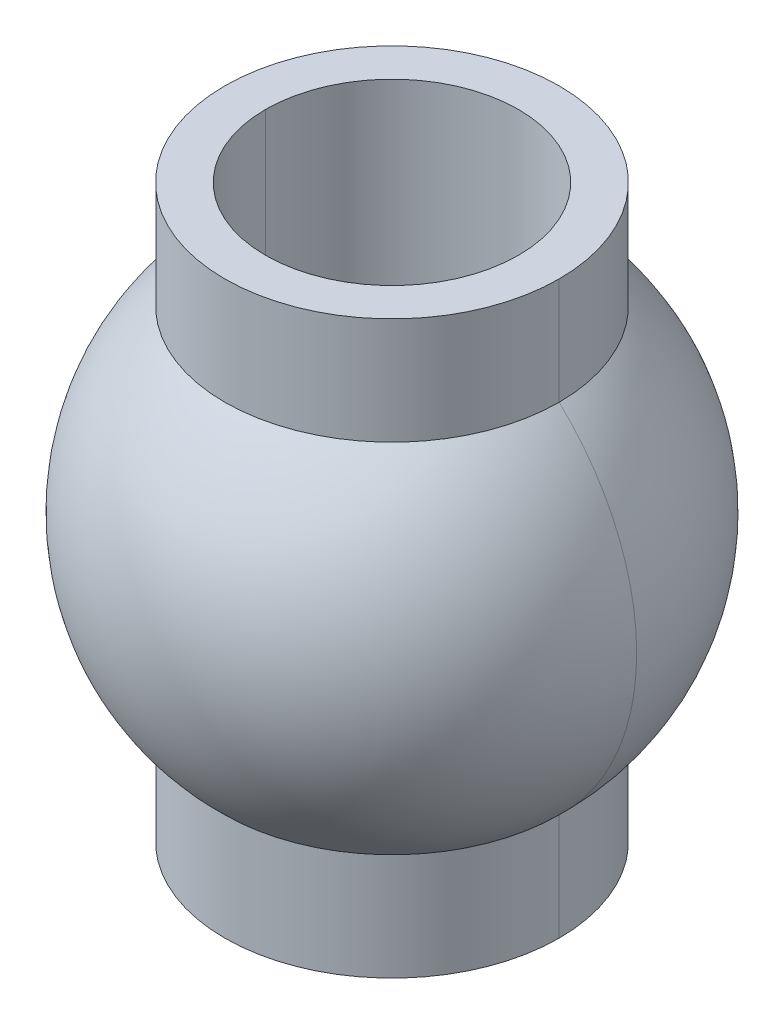
ISO-10303-21;
HEADER;
FILE_DESCRIPTION(('STEP AP214'),'2;1');
FILE_NAME('part.step','',(''),(''),'','','');
FILE_SCHEMA(('AUTOMOTIVE_DESIGN { 1 0 10303 214 1 1 1 1 }'));
ENDSEC;
DATA;
#1=APPLICATION_CONTEXT('core data for automotive mechanical design processes');
#2=APPLICATION_PROTOCOL_DEFINITION('international standard','automotive_design',2000,#1);
#3=PRODUCT_CONTEXT('',#1,'mechanical');
#4=PRODUCT('Part','Part','',(#3));
#5=PRODUCT_RELATED_PRODUCT_CATEGORY('part','',(#4));
#6=PRODUCT_DEFINITION_FORMATION('','',#4);
#7=PRODUCT_DEFINITION_CONTEXT('part definition',#1,'design');
#8=PRODUCT_DEFINITION('design','',#6,#7);
#9=PRODUCT_DEFINITION_SHAPE('','',#8);
#10=(LENGTH_UNIT() NAMED_UNIT(*) SI_UNIT(.MILLI.,.METRE.));
#11=(NAMED_UNIT(*) PLANE_ANGLE_UNIT() SI_UNIT($,.RADIAN.));
#12=(NAMED_UNIT(*) SI_UNIT($,.STERADIAN.) SOLID_ANGLE_UNIT());
#13=UNCERTAINTY_MEASURE_WITH_UNIT(LENGTH_MEASURE(1.E-05),#10,'distance_accuracy_value','');
#14=(GEOMETRIC_REPRESENTATION_CONTEXT(3) GLOBAL_UNCERTAINTY_ASSIGNED_CONTEXT((#13)) GLOBAL_UNIT_ASSIGNED_CONTEXT((#10,
#11,#12)) REPRESENTATION_CONTEXT('',''));
#15=CARTESIAN_POINT('',(0.,0.,0.));
#16=DIRECTION('',(0.,0.,1.));
#17=DIRECTION('',(1.,0.,0.));
#18=AXIS2_PLACEMENT_3D('',#15,#16,#17);
#19=CARTESIAN_POINT('',(0.,0.,0.));
#20=DIRECTION('',(0.,0.,-1.));
#21=DIRECTION('',(1.,0.,0.));
#22=AXIS2_PLACEMENT_3D('',#19,#20,#21);
#23=SPHERICAL_SURFACE('',#22,3.);
#24=CARTESIAN_POINT('',(0.,-2.19031961138095,0.));
#25=DIRECTION('',(0.,1.,0.));
#26=DIRECTION('',(-1.,0.,0.));
#27=AXIS2_PLACEMENT_3D('',#24,#25,#26);
#28=CIRCLE('',#27,2.05);
#29=CARTESIAN_POINT('',(2.05,-2.19031961138095,0.));
#30=VERTEX_POINT('',#29);
#31=CARTESIAN_POINT('',(-2.05,-2.19031961138095,0.));
#32=VERTEX_POINT('',#31);
#33=EDGE_CURVE('E11',#30,#32,#28,.T.);
#34=ORIENTED_EDGE('',*,*,#33,.T.);
#35=CARTESIAN_POINT('',(0.,0.,0.));
#36=DIRECTION('',(0.,0.,-1.));
#37=DIRECTION('',(-1.,0.,0.));
#38=AXIS2_PLACEMENT_3D('',#35,#36,#37);
#39=CIRCLE('',#38,3.);
#40=CARTESIAN_POINT('',(-2.05,2.19031961138095,0.));
#41=VERTEX_POINT('',#40);
#42=EDGE_CURVE('E27',#32,#41,#39,.T.);
#43=ORIENTED_EDGE('',*,*,#42,.T.);
#44=CARTESIAN_POINT('',(0.,2.19031961138095,0.));
#45=DIRECTION('',(0.,1.,0.));
#46=DIRECTION('',(-1.,0.,0.));
#47=AXIS2_PLACEMENT_3D('',#44,#45,#46);
#48=CIRCLE('',#47,2.05);
#49=CARTESIAN_POINT('',(2.05,2.19031961138095,0.));
#50=VERTEX_POINT('',#49);
#51=EDGE_CURVE('E142',#50,#41,#48,.T.);
#52=ORIENTED_EDGE('',*,*,#51,.F.);
#53=CARTESIAN_POINT('',(0.,0.,0.));
#54=DIRECTION('',(0.,0.,1.));
#55=DIRECTION('',(1.,0.,0.));
#56=AXIS2_PLACEMENT_3D('',#53,#54,#55);
#57=CIRCLE('',#56,3.);
#58=EDGE_CURVE('E136',#30,#50,#57,.T.);
#59=ORIENTED_EDGE('',*,*,#58,.F.);
#60=EDGE_LOOP('',(#34,#43,#52,#59));
#61=FACE_BOUND('',#60,.T.);
#62=ADVANCED_FACE('F16',(#61),#23,.T.);
#63=CARTESIAN_POINT('',(0.,3.5,0.));
#64=DIRECTION('',(0.,1.,0.));
#65=DIRECTION('',(-1.,0.,0.));
#66=AXIS2_PLACEMENT_3D('',#63,#64,#65);
#67=CYLINDRICAL_SURFACE('',#66,2.05);
#68=CARTESIAN_POINT('',(0.,-3.5,0.));
#69=DIRECTION('',(0.,1.,0.));
#70=DIRECTION('',(-1.,0.,0.));
#71=AXIS2_PLACEMENT_3D('',#68,#69,#70);
#72=CIRCLE('',#71,2.05);
#73=CARTESIAN_POINT('',(-2.05,-3.5,0.));
#74=VERTEX_POINT('',#73);
#75=CARTESIAN_POINT('',(2.05,-3.5,0.));
#76=VERTEX_POINT('',#75);
#77=EDGE_CURVE('E133',#74,#76,#72,.T.);
#78=ORIENTED_EDGE('',*,*,#77,.T.);
#79=DIRECTION('',(0.,1.,0.));
#80=VECTOR('',#79,1.);
#81=CARTESIAN_POINT('',(2.05,3.5,0.));
#82=LINE('',#81,#80);
#83=EDGE_CURVE('E115',#76,#30,#82,.T.);
#84=ORIENTED_EDGE('',*,*,#83,.T.);
#85=CARTESIAN_POINT('',(0.,-2.19031961138095,0.));
#86=DIRECTION('',(0.,1.,0.));
#87=DIRECTION('',(-1.,0.,0.));
#88=AXIS2_PLACEMENT_3D('',#85,#86,#87);
#89=CIRCLE('',#88,2.05);
#90=EDGE_CURVE('E42',#32,#30,#89,.T.);
#91=ORIENTED_EDGE('',*,*,#90,.F.);
#92=DIRECTION('',(0.,1.,0.));
#93=VECTOR('',#92,1.);
#94=CARTESIAN_POINT('',(-2.05,3.5,0.));
#95=LINE('',#94,#93);
#96=EDGE_CURVE('E135',#74,#32,#95,.T.);
#97=ORIENTED_EDGE('',*,*,#96,.F.);
#98=EDGE_LOOP('',(#78,#84,#91,#97));
#99=FACE_BOUND('',#98,.T.);
#100=ADVANCED_FACE('F196',(#99),#67,.T.);
#101=CARTESIAN_POINT('',(0.,3.5,0.));
#102=DIRECTION('',(0.,1.,0.));
#103=DIRECTION('',(-1.,0.,0.));
#104=AXIS2_PLACEMENT_3D('',#101,#102,#103);
#105=CYLINDRICAL_SURFACE('',#104,1.55);
#106=CARTESIAN_POINT('',(0.,-3.5,0.));
#107=DIRECTION('',(0.,1.,0.));
#108=DIRECTION('',(-1.,0.,0.));
#109=AXIS2_PLACEMENT_3D('',#106,#107,#108);
#110=CIRCLE('',#109,1.55);
#111=CARTESIAN_POINT('',(1.55,-3.5,0.));
#112=VERTEX_POINT('',#111);
#113=CARTESIAN_POINT('',(-1.55,-3.5,0.));
#114=VERTEX_POINT('',#113);
#115=EDGE_CURVE('E97',#112,#114,#110,.T.);
#116=ORIENTED_EDGE('',*,*,#115,.F.);
#117=DIRECTION('',(0.,1.,0.));
#118=VECTOR('',#117,1.);
#119=CARTESIAN_POINT('',(1.55,3.5,0.));
#120=LINE('',#119,#118);
#121=CARTESIAN_POINT('',(1.55,3.5,0.));
#122=VERTEX_POINT('',#121);
#123=EDGE_CURVE('E101',#112,#122,#120,.T.);
#124=ORIENTED_EDGE('',*,*,#123,.T.);
#125=CARTESIAN_POINT('',(0.,3.5,0.));
#126=DIRECTION('',(0.,1.,0.));
#127=DIRECTION('',(-1.,0.,0.));
#128=AXIS2_PLACEMENT_3D('',#125,#126,#127);
#129=CIRCLE('',#128,1.55);
#130=CARTESIAN_POINT('',(-1.55,3.5,0.));
#131=VERTEX_POINT('',#130);
#132=EDGE_CURVE('E116',#122,#131,#129,.T.);
#133=ORIENTED_EDGE('',*,*,#132,.T.);
#134=DIRECTION('',(0.,1.,0.));
#135=VECTOR('',#134,1.);
#136=CARTESIAN_POINT('',(-1.55,3.5,0.));
#137=LINE('',#136,#135);
#138=EDGE_CURVE('E20',#114,#131,#137,.T.);
#139=ORIENTED_EDGE('',*,*,#138,.F.);
#140=EDGE_LOOP('',(#116,#124,#133,#139));
#141=FACE_BOUND('',#140,.T.);
#142=ADVANCED_FACE('F99',(#141),#105,.F.);
#143=CARTESIAN_POINT('',(0.,3.5,0.));
#144=DIRECTION('',(0.,1.,0.));
#145=DIRECTION('',(-1.,0.,0.));
#146=AXIS2_PLACEMENT_3D('',#143,#144,#145);
#147=CYLINDRICAL_SURFACE('',#146,2.05);
#148=CARTESIAN_POINT('',(0.,2.19031961138095,0.));
#149=DIRECTION('',(0.,1.,0.));
#150=DIRECTION('',(-1.,0.,0.));
#151=AXIS2_PLACEMENT_3D('',#148,#149,#150);
#152=CIRCLE('',#151,2.05);
#153=EDGE_CURVE('E141',#41,#50,#152,.T.);
#154=ORIENTED_EDGE('',*,*,#153,.T.);
#155=DIRECTION('',(0.,1.,0.));
#156=VECTOR('',#155,1.);
#157=CARTESIAN_POINT('',(2.05,3.5,0.));
#158=LINE('',#157,#156);
#159=CARTESIAN_POINT('',(2.05,3.5,0.));
#160=VERTEX_POINT('',#159);
#161=EDGE_CURVE('E138',#50,#160,#158,.T.);
#162=ORIENTED_EDGE('',*,*,#161,.T.);
#163=CARTESIAN_POINT('',(0.,3.5,0.));
#164=DIRECTION('',(0.,1.,0.));
#165=DIRECTION('',(-1.,0.,0.));
#166=AXIS2_PLACEMENT_3D('',#163,#164,#165);
#167=CIRCLE('',#166,2.05);
#168=CARTESIAN_POINT('',(-2.05,3.5,0.));
#169=VERTEX_POINT('',#168);
#170=EDGE_CURVE('E74',#169,#160,#167,.T.);
#171=ORIENTED_EDGE('',*,*,#170,.F.);
#172=DIRECTION('',(0.,1.,0.));
#173=VECTOR('',#172,1.);
#174=CARTESIAN_POINT('',(-2.05,3.5,0.));
#175=LINE('',#174,#173);
#176=EDGE_CURVE('E163',#41,#169,#175,.T.);
#177=ORIENTED_EDGE('',*,*,#176,.F.);
#178=EDGE_LOOP('',(#154,#162,#171,#177));
#179=FACE_BOUND('',#178,.T.);
#180=ADVANCED_FACE('F170',(#179),#147,.T.);
#181=CARTESIAN_POINT('',(0.,3.5,0.));
#182=DIRECTION('',(0.,1.,0.));
#183=DIRECTION('',(-1.,0.,0.));
#184=AXIS2_PLACEMENT_3D('',#181,#182,#183);
#185=CYLINDRICAL_SURFACE('',#184,2.05);
#186=ORIENTED_EDGE('',*,*,#161,.F.);
#187=ORIENTED_EDGE('',*,*,#51,.T.);
#188=ORIENTED_EDGE('',*,*,#176,.T.);
#189=CARTESIAN_POINT('',(0.,3.5,0.));
#190=DIRECTION('',(0.,1.,0.));
#191=DIRECTION('',(-1.,0.,0.));
#192=AXIS2_PLACEMENT_3D('',#189,#190,#191);
#193=CIRCLE('',#192,2.05);
#194=EDGE_CURVE('E129',#160,#169,#193,.T.);
#195=ORIENTED_EDGE('',*,*,#194,.F.);
#196=EDGE_LOOP('',(#186,#187,#188,#195));
#197=FACE_BOUND('',#196,.T.);
#198=ADVANCED_FACE('F18',(#197),#185,.T.);
#199=CARTESIAN_POINT('',(1.55,3.5,0.));
#200=DIRECTION('',(0.,-1.,0.));
#201=DIRECTION('',(0.,0.,-1.));
#202=AXIS2_PLACEMENT_3D('',#199,#200,#201);
#203=PLANE('',#202);
#204=ORIENTED_EDGE('',*,*,#170,.T.);
#205=ORIENTED_EDGE('',*,*,#194,.T.);
#206=EDGE_LOOP('',(#204,#205));
#207=FACE_BOUND('',#206,.T.);
#208=CARTESIAN_POINT('',(0.,3.5,0.));
#209=DIRECTION('',(0.,1.,0.));
#210=DIRECTION('',(-1.,0.,0.));
#211=AXIS2_PLACEMENT_3D('',#208,#209,#210);
#212=CIRCLE('',#211,1.55);
#213=EDGE_CURVE('E113',#131,#122,#212,.T.);
#214=ORIENTED_EDGE('',*,*,#213,.F.);
#215=ORIENTED_EDGE('',*,*,#132,.F.);
#216=EDGE_LOOP('',(#214,#215));
#217=FACE_BOUND('',#216,.T.);
#218=ADVANCED_FACE('F184',(#207,#217),#203,.F.);
#219=CARTESIAN_POINT('',(0.,3.5,0.));
#220=DIRECTION('',(0.,1.,0.));
#221=DIRECTION('',(-1.,0.,0.));
#222=AXIS2_PLACEMENT_3D('',#219,#220,#221);
#223=CYLINDRICAL_SURFACE('',#222,1.55);
#224=ORIENTED_EDGE('',*,*,#123,.F.);
#225=CARTESIAN_POINT('',(0.,-3.5,0.));
#226=DIRECTION('',(0.,1.,0.));
#227=DIRECTION('',(-1.,0.,0.));
#228=AXIS2_PLACEMENT_3D('',#225,#226,#227);
#229=CIRCLE('',#228,1.55);
#230=EDGE_CURVE('E107',#114,#112,#229,.T.);
#231=ORIENTED_EDGE('',*,*,#230,.F.);
#232=ORIENTED_EDGE('',*,*,#138,.T.);
#233=ORIENTED_EDGE('',*,*,#213,.T.);
#234=EDGE_LOOP('',(#224,#231,#232,#233));
#235=FACE_BOUND('',#234,.T.);
#236=ADVANCED_FACE('F111',(#235),#223,.F.);
#237=CARTESIAN_POINT('',(1.55,-3.5,0.));
#238=DIRECTION('',(0.,1.,0.));
#239=DIRECTION('',(1.,0.,0.));
#240=AXIS2_PLACEMENT_3D('',#237,#238,#239);
#241=PLANE('',#240);
#242=ORIENTED_EDGE('',*,*,#77,.F.);
#243=CARTESIAN_POINT('',(0.,-3.5,0.));
#244=DIRECTION('',(0.,1.,0.));
#245=DIRECTION('',(-1.,0.,0.));
#246=AXIS2_PLACEMENT_3D('',#243,#244,#245);
#247=CIRCLE('',#246,2.05);
#248=EDGE_CURVE('E108',#76,#74,#247,.T.);
#249=ORIENTED_EDGE('',*,*,#248,.F.);
#250=EDGE_LOOP('',(#242,#249));
#251=FACE_BOUND('',#250,.T.);
#252=ORIENTED_EDGE('',*,*,#230,.T.);
#253=ORIENTED_EDGE('',*,*,#115,.T.);
#254=EDGE_LOOP('',(#252,#253));
#255=FACE_BOUND('',#254,.T.);
#256=ADVANCED_FACE('F118',(#251,#255),#241,.F.);
#257=CARTESIAN_POINT('',(0.,3.5,0.));
#258=DIRECTION('',(0.,1.,0.));
#259=DIRECTION('',(-1.,0.,0.));
#260=AXIS2_PLACEMENT_3D('',#257,#258,#259);
#261=CYLINDRICAL_SURFACE('',#260,2.05);
#262=ORIENTED_EDGE('',*,*,#83,.F.);
#263=ORIENTED_EDGE('',*,*,#248,.T.);
#264=ORIENTED_EDGE('',*,*,#96,.T.);
#265=ORIENTED_EDGE('',*,*,#33,.F.);
#266=EDGE_LOOP('',(#262,#263,#264,#265));
#267=FACE_BOUND('',#266,.T.);
#268=ADVANCED_FACE('F206',(#267),#261,.T.);
#269=CARTESIAN_POINT('',(0.,0.,0.));
#270=DIRECTION('',(0.,0.,-1.));
#271=DIRECTION('',(1.,0.,0.));
#272=AXIS2_PLACEMENT_3D('',#269,#270,#271);
#273=SPHERICAL_SURFACE('',#272,3.);
#274=ORIENTED_EDGE('',*,*,#42,.F.);
#275=ORIENTED_EDGE('',*,*,#90,.T.);
#276=ORIENTED_EDGE('',*,*,#58,.T.);
#277=ORIENTED_EDGE('',*,*,#153,.F.);
#278=EDGE_LOOP('',(#274,#275,#276,#277));
#279=FACE_BOUND('',#278,.T.);
#280=ADVANCED_FACE('F209',(#279),#273,.T.);
#281=CLOSED_SHELL('',(#62,#100,#142,#180,#198,#218,#236,#256,#268,#280));
#282=MANIFOLD_SOLID_BREP('B1',#281);
#283=ADVANCED_BREP_SHAPE_REPRESENTATION('',(#18,#282),#14);
#284=SHAPE_DEFINITION_REPRESENTATION(#9,#283);
ENDSEC;
END-ISO-10303-21;
